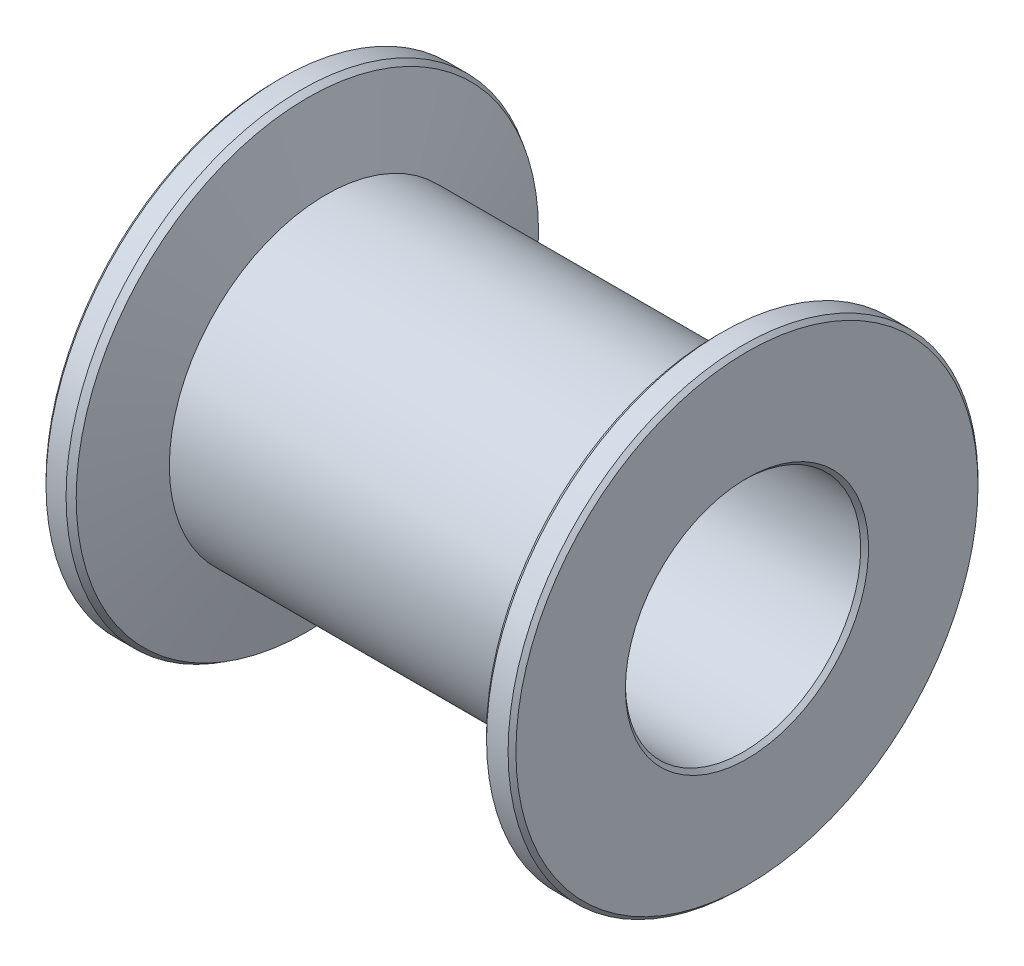
ISO-10303-21;
HEADER;
FILE_DESCRIPTION(('STEP AP214'),'2;1');
FILE_NAME('part.step','',(''),(''),'','','');
FILE_SCHEMA(('AUTOMOTIVE_DESIGN { 1 0 10303 214 1 1 1 1 }'));
ENDSEC;
DATA;
#1=APPLICATION_CONTEXT('core data for automotive mechanical design processes');
#2=APPLICATION_PROTOCOL_DEFINITION('international standard','automotive_design',2000,#1);
#3=PRODUCT_CONTEXT('',#1,'mechanical');
#4=PRODUCT('Part','Part','',(#3));
#5=PRODUCT_RELATED_PRODUCT_CATEGORY('part','',(#4));
#6=PRODUCT_DEFINITION_FORMATION('','',#4);
#7=PRODUCT_DEFINITION_CONTEXT('part definition',#1,'design');
#8=PRODUCT_DEFINITION('design','',#6,#7);
#9=PRODUCT_DEFINITION_SHAPE('','',#8);
#10=(LENGTH_UNIT() NAMED_UNIT(*) SI_UNIT(.MILLI.,.METRE.));
#11=(NAMED_UNIT(*) PLANE_ANGLE_UNIT() SI_UNIT($,.RADIAN.));
#12=(NAMED_UNIT(*) SI_UNIT($,.STERADIAN.) SOLID_ANGLE_UNIT());
#13=UNCERTAINTY_MEASURE_WITH_UNIT(LENGTH_MEASURE(1.E-05),#10,'distance_accuracy_value','');
#14=(GEOMETRIC_REPRESENTATION_CONTEXT(3) GLOBAL_UNCERTAINTY_ASSIGNED_CONTEXT((#13)) GLOBAL_UNIT_ASSIGNED_CONTEXT((#10,
#11,#12)) REPRESENTATION_CONTEXT('',''));
#15=CARTESIAN_POINT('',(0.,0.,0.));
#16=DIRECTION('',(0.,0.,1.));
#17=DIRECTION('',(1.,0.,0.));
#18=AXIS2_PLACEMENT_3D('',#15,#16,#17);
#19=CARTESIAN_POINT('',(6.,0.,0.));
#20=DIRECTION('',(-1.,0.,0.));
#21=DIRECTION('',(0.,0.,1.));
#22=AXIS2_PLACEMENT_3D('',#19,#20,#21);
#23=CYLINDRICAL_SURFACE('',#22,6.);
#24=CARTESIAN_POINT('',(-5.38743685418726,0.,0.));
#25=DIRECTION('',(-1.,0.,0.));
#26=DIRECTION('',(0.,0.,1.));
#27=AXIS2_PLACEMENT_3D('',#24,#25,#26);
#28=CIRCLE('',#27,6.);
#29=CARTESIAN_POINT('',(-5.38743685418726,0.,6.));
#30=VERTEX_POINT('',#29);
#31=EDGE_CURVE('E10',#30,#30,#28,.T.);
#32=ORIENTED_EDGE('',*,*,#31,.T.);
#33=EDGE_LOOP('',(#32));
#34=FACE_BOUND('',#33,.T.);
#35=CARTESIAN_POINT('',(-5.9,0.,0.));
#36=DIRECTION('',(-1.,0.,0.));
#37=DIRECTION('',(0.,0.,1.));
#38=AXIS2_PLACEMENT_3D('',#35,#36,#37);
#39=CIRCLE('',#38,6.);
#40=CARTESIAN_POINT('',(-5.9,0.,6.));
#41=VERTEX_POINT('',#40);
#42=EDGE_CURVE('E87',#41,#41,#39,.T.);
#43=ORIENTED_EDGE('',*,*,#42,.F.);
#44=EDGE_LOOP('',(#43));
#45=FACE_BOUND('',#44,.T.);
#46=ADVANCED_FACE('F41',(#34,#45),#23,.T.);
#47=CARTESIAN_POINT('',(-5.38743685418726,0.,0.));
#48=DIRECTION('',(-1.,0.,0.));
#49=DIRECTION('',(0.,0.,1.));
#50=AXIS2_PLACEMENT_3D('',#47,#48,#49);
#51=CONICAL_SURFACE('',#50,6.,0.540419500270603);
#52=CARTESIAN_POINT('',(-5.22574643749637,0.,0.));
#53=DIRECTION('',(-1.,0.,0.));
#54=DIRECTION('',(0.,0.,1.));
#55=AXIS2_PLACEMENT_3D('',#52,#53,#54);
#56=CIRCLE('',#55,5.90298574998546);
#57=CARTESIAN_POINT('',(-5.22574643749637,0.,5.90298574998546));
#58=VERTEX_POINT('',#57);
#59=EDGE_CURVE('E47',#58,#58,#56,.T.);
#60=ORIENTED_EDGE('',*,*,#59,.T.);
#61=EDGE_LOOP('',(#60));
#62=FACE_BOUND('',#61,.T.);
#63=ORIENTED_EDGE('',*,*,#31,.F.);
#64=EDGE_LOOP('',(#63));
#65=FACE_BOUND('',#64,.T.);
#66=ADVANCED_FACE('F95',(#62,#65),#51,.T.);
#67=CARTESIAN_POINT('',(-5.22574643749637,0.,0.));
#68=DIRECTION('',(-1.,0.,0.));
#69=DIRECTION('',(0.,0.,1.));
#70=AXIS2_PLACEMENT_3D('',#67,#68,#69);
#71=CONICAL_SURFACE('',#70,5.90298574998546,1.32581766366803);
#72=CARTESIAN_POINT('',(-4.75,0.,0.));
#73=DIRECTION('',(-1.,0.,0.));
#74=DIRECTION('',(0.,0.,1.));
#75=AXIS2_PLACEMENT_3D('',#72,#73,#74);
#76=CIRCLE('',#75,4.);
#77=CARTESIAN_POINT('',(-4.75,0.,4.));
#78=VERTEX_POINT('',#77);
#79=EDGE_CURVE('E51',#78,#78,#76,.T.);
#80=ORIENTED_EDGE('',*,*,#79,.T.);
#81=EDGE_LOOP('',(#80));
#82=FACE_BOUND('',#81,.T.);
#83=ORIENTED_EDGE('',*,*,#59,.F.);
#84=EDGE_LOOP('',(#83));
#85=FACE_BOUND('',#84,.T.);
#86=ADVANCED_FACE('F99',(#82,#85),#71,.T.);
#87=CARTESIAN_POINT('',(6.,0.,0.));
#88=DIRECTION('',(-1.,0.,0.));
#89=DIRECTION('',(0.,0.,1.));
#90=AXIS2_PLACEMENT_3D('',#87,#88,#89);
#91=CYLINDRICAL_SURFACE('',#90,4.);
#92=CARTESIAN_POINT('',(4.75,0.,0.));
#93=DIRECTION('',(-1.,0.,0.));
#94=DIRECTION('',(0.,0.,1.));
#95=AXIS2_PLACEMENT_3D('',#92,#93,#94);
#96=CIRCLE('',#95,4.00000000000001);
#97=CARTESIAN_POINT('',(4.75,0.,4.00000000000001));
#98=VERTEX_POINT('',#97);
#99=EDGE_CURVE('E55',#98,#98,#96,.T.);
#100=ORIENTED_EDGE('',*,*,#99,.T.);
#101=EDGE_LOOP('',(#100));
#102=FACE_BOUND('',#101,.T.);
#103=ORIENTED_EDGE('',*,*,#79,.F.);
#104=EDGE_LOOP('',(#103));
#105=FACE_BOUND('',#104,.T.);
#106=ADVANCED_FACE('F103',(#102,#105),#91,.T.);
#107=CARTESIAN_POINT('',(4.75,0.,0.));
#108=DIRECTION('',(1.,0.,0.));
#109=DIRECTION('',(0.,0.,-1.));
#110=AXIS2_PLACEMENT_3D('',#107,#108,#109);
#111=CONICAL_SURFACE('',#110,4.00000000000001,1.32581766366803);
#112=CARTESIAN_POINT('',(5.21666666666667,0.,0.));
#113=DIRECTION('',(-1.,0.,0.));
#114=DIRECTION('',(0.,0.,1.));
#115=AXIS2_PLACEMENT_3D('',#112,#113,#114);
#116=CIRCLE('',#115,5.86666666666667);
#117=CARTESIAN_POINT('',(5.21666666666667,0.,5.86666666666667));
#118=VERTEX_POINT('',#117);
#119=EDGE_CURVE('E60',#118,#118,#116,.T.);
#120=ORIENTED_EDGE('',*,*,#119,.T.);
#121=EDGE_LOOP('',(#120));
#122=FACE_BOUND('',#121,.T.);
#123=ORIENTED_EDGE('',*,*,#99,.F.);
#124=EDGE_LOOP('',(#123));
#125=FACE_BOUND('',#124,.T.);
#126=ADVANCED_FACE('F110',(#122,#125),#111,.T.);
#127=CARTESIAN_POINT('',(5.21666666666667,0.,0.));
#128=DIRECTION('',(1.,0.,0.));
#129=DIRECTION('',(0.,0.,-1.));
#130=AXIS2_PLACEMENT_3D('',#127,#128,#129);
#131=CONICAL_SURFACE('',#130,5.86666666666667,0.785398163397448);
#132=CARTESIAN_POINT('',(5.35,0.,0.));
#133=DIRECTION('',(-1.,0.,0.));
#134=DIRECTION('',(0.,0.,1.));
#135=AXIS2_PLACEMENT_3D('',#132,#133,#134);
#136=CIRCLE('',#135,6.);
#137=CARTESIAN_POINT('',(5.35,0.,6.));
#138=VERTEX_POINT('',#137);
#139=EDGE_CURVE('E63',#138,#138,#136,.T.);
#140=ORIENTED_EDGE('',*,*,#139,.T.);
#141=EDGE_LOOP('',(#140));
#142=FACE_BOUND('',#141,.T.);
#143=ORIENTED_EDGE('',*,*,#119,.F.);
#144=EDGE_LOOP('',(#143));
#145=FACE_BOUND('',#144,.T.);
#146=ADVANCED_FACE('F114',(#142,#145),#131,.T.);
#147=CARTESIAN_POINT('',(6.,0.,0.));
#148=DIRECTION('',(-1.,0.,0.));
#149=DIRECTION('',(0.,0.,1.));
#150=AXIS2_PLACEMENT_3D('',#147,#148,#149);
#151=CYLINDRICAL_SURFACE('',#150,6.);
#152=CARTESIAN_POINT('',(5.9,0.,0.));
#153=DIRECTION('',(-1.,0.,0.));
#154=DIRECTION('',(0.,0.,1.));
#155=AXIS2_PLACEMENT_3D('',#152,#153,#154);
#156=CIRCLE('',#155,6.);
#157=CARTESIAN_POINT('',(5.9,0.,6.));
#158=VERTEX_POINT('',#157);
#159=EDGE_CURVE('E66',#158,#158,#156,.T.);
#160=ORIENTED_EDGE('',*,*,#159,.T.);
#161=EDGE_LOOP('',(#160));
#162=FACE_BOUND('',#161,.T.);
#163=ORIENTED_EDGE('',*,*,#139,.F.);
#164=EDGE_LOOP('',(#163));
#165=FACE_BOUND('',#164,.T.);
#166=ADVANCED_FACE('F118',(#162,#165),#151,.T.);
#167=CARTESIAN_POINT('',(5.9,0.,0.));
#168=DIRECTION('',(-1.,0.,0.));
#169=DIRECTION('',(0.,0.,1.));
#170=AXIS2_PLACEMENT_3D('',#167,#168,#169);
#171=CONICAL_SURFACE('',#170,6.,0.785398163397453);
#172=CARTESIAN_POINT('',(6.,0.,0.));
#173=DIRECTION('',(-1.,0.,0.));
#174=DIRECTION('',(0.,0.,1.));
#175=AXIS2_PLACEMENT_3D('',#172,#173,#174);
#176=CIRCLE('',#175,5.9);
#177=CARTESIAN_POINT('',(6.,0.,5.9));
#178=VERTEX_POINT('',#177);
#179=EDGE_CURVE('E69',#178,#178,#176,.T.);
#180=ORIENTED_EDGE('',*,*,#179,.T.);
#181=EDGE_LOOP('',(#180));
#182=FACE_BOUND('',#181,.T.);
#183=ORIENTED_EDGE('',*,*,#159,.F.);
#184=EDGE_LOOP('',(#183));
#185=FACE_BOUND('',#184,.T.);
#186=ADVANCED_FACE('F122',(#182,#185),#171,.T.);
#187=CARTESIAN_POINT('',(6.,5.9,0.));
#188=DIRECTION('',(1.,0.,0.));
#189=DIRECTION('',(0.,0.,-1.));
#190=AXIS2_PLACEMENT_3D('',#187,#188,#189);
#191=PLANE('',#190);
#192=CARTESIAN_POINT('',(6.,0.,0.));
#193=DIRECTION('',(-1.,0.,0.));
#194=DIRECTION('',(0.,0.,1.));
#195=AXIS2_PLACEMENT_3D('',#192,#193,#194);
#196=CIRCLE('',#195,3.105);
#197=CARTESIAN_POINT('',(6.,0.,3.105));
#198=VERTEX_POINT('',#197);
#199=EDGE_CURVE('E72',#198,#198,#196,.T.);
#200=ORIENTED_EDGE('',*,*,#199,.T.);
#201=EDGE_LOOP('',(#200));
#202=FACE_BOUND('',#201,.T.);
#203=ORIENTED_EDGE('',*,*,#179,.F.);
#204=EDGE_LOOP('',(#203));
#205=FACE_BOUND('',#204,.T.);
#206=ADVANCED_FACE('F126',(#202,#205),#191,.T.);
#207=CARTESIAN_POINT('',(6.,0.,0.));
#208=DIRECTION('',(1.,0.,0.));
#209=DIRECTION('',(0.,0.,-1.));
#210=AXIS2_PLACEMENT_3D('',#207,#208,#209);
#211=CONICAL_SURFACE('',#210,3.105,0.785398163397448);
#212=CARTESIAN_POINT('',(5.9,0.,0.));
#213=DIRECTION('',(-1.,0.,0.));
#214=DIRECTION('',(0.,0.,1.));
#215=AXIS2_PLACEMENT_3D('',#212,#213,#214);
#216=CIRCLE('',#215,3.005);
#217=CARTESIAN_POINT('',(5.9,0.,3.005));
#218=VERTEX_POINT('',#217);
#219=EDGE_CURVE('E75',#218,#218,#216,.T.);
#220=ORIENTED_EDGE('',*,*,#219,.T.);
#221=EDGE_LOOP('',(#220));
#222=FACE_BOUND('',#221,.T.);
#223=ORIENTED_EDGE('',*,*,#199,.F.);
#224=EDGE_LOOP('',(#223));
#225=FACE_BOUND('',#224,.T.);
#226=ADVANCED_FACE('F130',(#222,#225),#211,.F.);
#227=CARTESIAN_POINT('',(6.,0.,0.));
#228=DIRECTION('',(-1.,0.,0.));
#229=DIRECTION('',(0.,0.,1.));
#230=AXIS2_PLACEMENT_3D('',#227,#228,#229);
#231=CYLINDRICAL_SURFACE('',#230,3.005);
#232=CARTESIAN_POINT('',(-5.9,0.,0.));
#233=DIRECTION('',(-1.,0.,0.));
#234=DIRECTION('',(0.,0.,1.));
#235=AXIS2_PLACEMENT_3D('',#232,#233,#234);
#236=CIRCLE('',#235,3.005);
#237=CARTESIAN_POINT('',(-5.9,0.,3.005));
#238=VERTEX_POINT('',#237);
#239=EDGE_CURVE('E78',#238,#238,#236,.T.);
#240=ORIENTED_EDGE('',*,*,#239,.T.);
#241=EDGE_LOOP('',(#240));
#242=FACE_BOUND('',#241,.T.);
#243=ORIENTED_EDGE('',*,*,#219,.F.);
#244=EDGE_LOOP('',(#243));
#245=FACE_BOUND('',#244,.T.);
#246=ADVANCED_FACE('F134',(#242,#245),#231,.F.);
#247=CARTESIAN_POINT('',(-5.9,0.,0.));
#248=DIRECTION('',(-1.,0.,0.));
#249=DIRECTION('',(0.,0.,1.));
#250=AXIS2_PLACEMENT_3D('',#247,#248,#249);
#251=CONICAL_SURFACE('',#250,3.005,0.785398163397455);
#252=CARTESIAN_POINT('',(-6.,0.,0.));
#253=DIRECTION('',(-1.,0.,0.));
#254=DIRECTION('',(0.,0.,1.));
#255=AXIS2_PLACEMENT_3D('',#252,#253,#254);
#256=CIRCLE('',#255,3.105);
#257=CARTESIAN_POINT('',(-6.,0.,3.105));
#258=VERTEX_POINT('',#257);
#259=EDGE_CURVE('E81',#258,#258,#256,.T.);
#260=ORIENTED_EDGE('',*,*,#259,.T.);
#261=EDGE_LOOP('',(#260));
#262=FACE_BOUND('',#261,.T.);
#263=ORIENTED_EDGE('',*,*,#239,.F.);
#264=EDGE_LOOP('',(#263));
#265=FACE_BOUND('',#264,.T.);
#266=ADVANCED_FACE('F138',(#262,#265),#251,.F.);
#267=CARTESIAN_POINT('',(-6.,3.105,0.));
#268=DIRECTION('',(-1.,0.,0.));
#269=DIRECTION('',(0.,0.,1.));
#270=AXIS2_PLACEMENT_3D('',#267,#268,#269);
#271=PLANE('',#270);
#272=CARTESIAN_POINT('',(-6.,0.,0.));
#273=DIRECTION('',(-1.,0.,0.));
#274=DIRECTION('',(0.,0.,1.));
#275=AXIS2_PLACEMENT_3D('',#272,#273,#274);
#276=CIRCLE('',#275,5.9);
#277=CARTESIAN_POINT('',(-6.,0.,5.9));
#278=VERTEX_POINT('',#277);
#279=EDGE_CURVE('E84',#278,#278,#276,.T.);
#280=ORIENTED_EDGE('',*,*,#279,.T.);
#281=EDGE_LOOP('',(#280));
#282=FACE_BOUND('',#281,.T.);
#283=ORIENTED_EDGE('',*,*,#259,.F.);
#284=EDGE_LOOP('',(#283));
#285=FACE_BOUND('',#284,.T.);
#286=ADVANCED_FACE('F142',(#282,#285),#271,.T.);
#287=CARTESIAN_POINT('',(-6.,0.,0.));
#288=DIRECTION('',(1.,0.,0.));
#289=DIRECTION('',(0.,0.,-1.));
#290=AXIS2_PLACEMENT_3D('',#287,#288,#289);
#291=CONICAL_SURFACE('',#290,5.9,0.785398163397448);
#292=ORIENTED_EDGE('',*,*,#42,.T.);
#293=EDGE_LOOP('',(#292));
#294=FACE_BOUND('',#293,.T.);
#295=ORIENTED_EDGE('',*,*,#279,.F.);
#296=EDGE_LOOP('',(#295));
#297=FACE_BOUND('',#296,.T.);
#298=ADVANCED_FACE('F91',(#294,#297),#291,.T.);
#299=CLOSED_SHELL('',(#46,#66,#86,#106,#126,#146,#166,#186,#206,#226,#246,#266,#286,#298));
#300=MANIFOLD_SOLID_BREP('B2',#299);
#301=ADVANCED_BREP_SHAPE_REPRESENTATION('',(#18,#300),#14);
#302=SHAPE_DEFINITION_REPRESENTATION(#9,#301);
ENDSEC;
END-ISO-10303-21;
